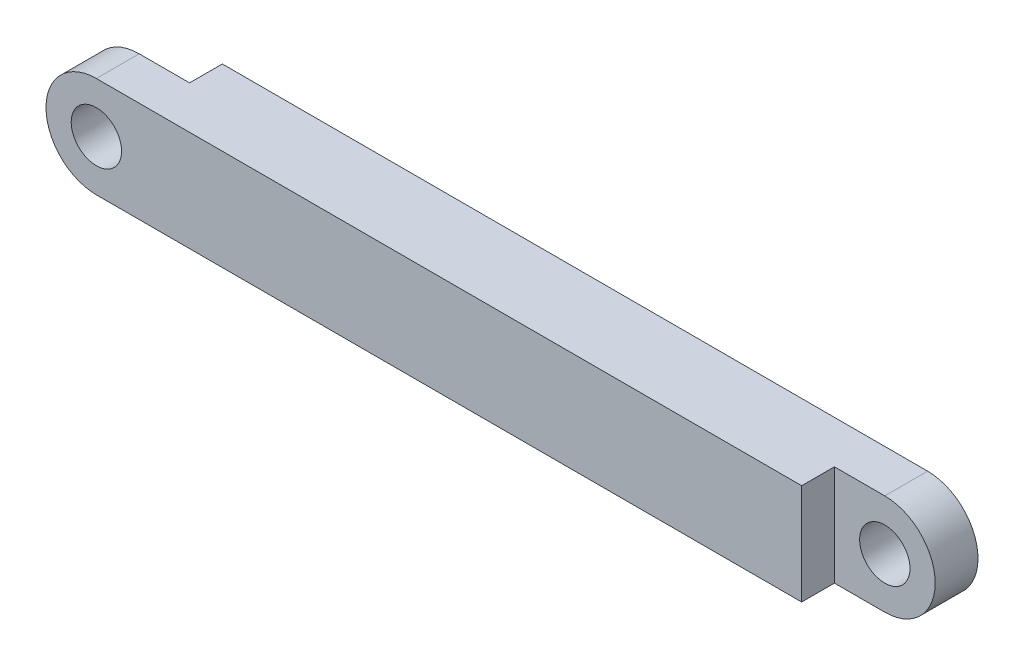
ISO-10303-21;
HEADER;
FILE_DESCRIPTION(('STEP AP214'),'2;1');
FILE_NAME('part.step','',(''),(''),'','','');
FILE_SCHEMA(('AUTOMOTIVE_DESIGN { 1 0 10303 214 1 1 1 1 }'));
ENDSEC;
DATA;
#1=APPLICATION_CONTEXT('core data for automotive mechanical design processes');
#2=APPLICATION_PROTOCOL_DEFINITION('international standard','automotive_design',2000,#1);
#3=PRODUCT_CONTEXT('',#1,'mechanical');
#4=PRODUCT('Part','Part','',(#3));
#5=PRODUCT_RELATED_PRODUCT_CATEGORY('part','',(#4));
#6=PRODUCT_DEFINITION_FORMATION('','',#4);
#7=PRODUCT_DEFINITION_CONTEXT('part definition',#1,'design');
#8=PRODUCT_DEFINITION('design','',#6,#7);
#9=PRODUCT_DEFINITION_SHAPE('','',#8);
#10=(LENGTH_UNIT() NAMED_UNIT(*) SI_UNIT(.MILLI.,.METRE.));
#11=(NAMED_UNIT(*) PLANE_ANGLE_UNIT() SI_UNIT($,.RADIAN.));
#12=(NAMED_UNIT(*) SI_UNIT($,.STERADIAN.) SOLID_ANGLE_UNIT());
#13=UNCERTAINTY_MEASURE_WITH_UNIT(LENGTH_MEASURE(1.E-05),#10,'distance_accuracy_value','');
#14=(GEOMETRIC_REPRESENTATION_CONTEXT(3) GLOBAL_UNCERTAINTY_ASSIGNED_CONTEXT((#13)) GLOBAL_UNIT_ASSIGNED_CONTEXT((#10,
#11,#12)) REPRESENTATION_CONTEXT('',''));
#15=CARTESIAN_POINT('',(0.,0.,0.));
#16=DIRECTION('',(0.,0.,1.));
#17=DIRECTION('',(1.,0.,0.));
#18=AXIS2_PLACEMENT_3D('',#15,#16,#17);
#19=CARTESIAN_POINT('',(-300.,0.,15.));
#20=DIRECTION('',(0.,0.,-1.));
#21=DIRECTION('',(-1.,0.,0.));
#22=AXIS2_PLACEMENT_3D('',#19,#20,#21);
#23=CYLINDRICAL_SURFACE('',#22,20.);
#24=CARTESIAN_POINT('',(-300.,0.,-2.));
#25=DIRECTION('',(0.,0.,-1.));
#26=DIRECTION('',(-1.,0.,0.));
#27=AXIS2_PLACEMENT_3D('',#24,#25,#26);
#28=CIRCLE('',#27,20.);
#29=CARTESIAN_POINT('',(-300.,-20.,-2.));
#30=VERTEX_POINT('',#29);
#31=CARTESIAN_POINT('',(-300.,20.,-2.));
#32=VERTEX_POINT('',#31);
#33=EDGE_CURVE('E103',#30,#32,#28,.T.);
#34=ORIENTED_EDGE('',*,*,#33,.F.);
#35=DIRECTION('',(0.,0.,-1.));
#36=VECTOR('',#35,1.);
#37=CARTESIAN_POINT('',(-300.,-20.,15.));
#38=LINE('',#37,#36);
#39=CARTESIAN_POINT('',(-300.,-20.,15.));
#40=VERTEX_POINT('',#39);
#41=EDGE_CURVE('E166',#40,#30,#38,.T.);
#42=ORIENTED_EDGE('',*,*,#41,.F.);
#43=CARTESIAN_POINT('',(-300.,0.,15.));
#44=DIRECTION('',(0.,0.,1.));
#45=DIRECTION('',(-1.,0.,0.));
#46=AXIS2_PLACEMENT_3D('',#43,#44,#45);
#47=CIRCLE('',#46,20.);
#48=CARTESIAN_POINT('',(-300.,20.,15.));
#49=VERTEX_POINT('',#48);
#50=EDGE_CURVE('E153',#49,#40,#47,.T.);
#51=ORIENTED_EDGE('',*,*,#50,.F.);
#52=DIRECTION('',(0.,0.,-1.));
#53=VECTOR('',#52,1.);
#54=CARTESIAN_POINT('',(-300.,20.,15.));
#55=LINE('',#54,#53);
#56=EDGE_CURVE('E44',#49,#32,#55,.T.);
#57=ORIENTED_EDGE('',*,*,#56,.T.);
#58=EDGE_LOOP('',(#34,#42,#51,#57));
#59=FACE_BOUND('',#58,.T.);
#60=ADVANCED_FACE('F35',(#59),#23,.T.);
#61=CARTESIAN_POINT('',(-300.,0.,15.));
#62=DIRECTION('',(0.,0.,-1.));
#63=DIRECTION('',(-1.,0.,0.));
#64=AXIS2_PLACEMENT_3D('',#61,#62,#63);
#65=CYLINDRICAL_SURFACE('',#64,10.);
#66=CARTESIAN_POINT('',(-300.,0.,15.));
#67=DIRECTION('',(0.,0.,1.));
#68=DIRECTION('',(1.,0.,0.));
#69=AXIS2_PLACEMENT_3D('',#66,#67,#68);
#70=CIRCLE('',#69,10.);
#71=CARTESIAN_POINT('',(-290.,0.,15.));
#72=VERTEX_POINT('',#71);
#73=EDGE_CURVE('E144',#72,#72,#70,.T.);
#74=ORIENTED_EDGE('',*,*,#73,.T.);
#75=EDGE_LOOP('',(#74));
#76=FACE_BOUND('',#75,.T.);
#77=CARTESIAN_POINT('',(-300.,0.,-2.));
#78=DIRECTION('',(0.,0.,-1.));
#79=DIRECTION('',(-1.,0.,0.));
#80=AXIS2_PLACEMENT_3D('',#77,#78,#79);
#81=CIRCLE('',#80,10.);
#82=CARTESIAN_POINT('',(-310.,0.,-2.));
#83=VERTEX_POINT('',#82);
#84=EDGE_CURVE('E39',#83,#83,#81,.T.);
#85=ORIENTED_EDGE('',*,*,#84,.T.);
#86=EDGE_LOOP('',(#85));
#87=FACE_BOUND('',#86,.T.);
#88=ADVANCED_FACE('F212',(#76,#87),#65,.F.);
#89=CARTESIAN_POINT('',(0.,0.,15.));
#90=DIRECTION('',(0.,0.,-1.));
#91=DIRECTION('',(-1.,0.,0.));
#92=AXIS2_PLACEMENT_3D('',#89,#90,#91);
#93=CYLINDRICAL_SURFACE('',#92,20.);
#94=CARTESIAN_POINT('',(0.,0.,2.));
#95=DIRECTION('',(0.,0.,1.));
#96=DIRECTION('',(1.,0.,0.));
#97=AXIS2_PLACEMENT_3D('',#94,#95,#96);
#98=CIRCLE('',#97,20.);
#99=CARTESIAN_POINT('',(0.,-20.,2.));
#100=VERTEX_POINT('',#99);
#101=CARTESIAN_POINT('',(0.,20.,2.));
#102=VERTEX_POINT('',#101);
#103=EDGE_CURVE('E142',#100,#102,#98,.T.);
#104=ORIENTED_EDGE('',*,*,#103,.F.);
#105=DIRECTION('',(0.,0.,-1.));
#106=VECTOR('',#105,1.);
#107=CARTESIAN_POINT('',(0.,-20.,15.));
#108=LINE('',#107,#106);
#109=CARTESIAN_POINT('',(0.,-20.,-15.));
#110=VERTEX_POINT('',#109);
#111=EDGE_CURVE('E159',#100,#110,#108,.T.);
#112=ORIENTED_EDGE('',*,*,#111,.T.);
#113=CARTESIAN_POINT('',(0.,0.,-15.));
#114=DIRECTION('',(0.,0.,1.));
#115=DIRECTION('',(-1.,0.,0.));
#116=AXIS2_PLACEMENT_3D('',#113,#114,#115);
#117=CIRCLE('',#116,20.);
#118=CARTESIAN_POINT('',(0.,20.,-15.));
#119=VERTEX_POINT('',#118);
#120=EDGE_CURVE('E150',#110,#119,#117,.T.);
#121=ORIENTED_EDGE('',*,*,#120,.T.);
#122=DIRECTION('',(0.,0.,-1.));
#123=VECTOR('',#122,1.);
#124=CARTESIAN_POINT('',(0.,20.,15.));
#125=LINE('',#124,#123);
#126=EDGE_CURVE('E11',#102,#119,#125,.T.);
#127=ORIENTED_EDGE('',*,*,#126,.F.);
#128=EDGE_LOOP('',(#104,#112,#121,#127));
#129=FACE_BOUND('',#128,.T.);
#130=ADVANCED_FACE('F37',(#129),#93,.T.);
#131=CARTESIAN_POINT('',(0.,0.,15.));
#132=DIRECTION('',(0.,0.,-1.));
#133=DIRECTION('',(-1.,0.,0.));
#134=AXIS2_PLACEMENT_3D('',#131,#132,#133);
#135=CYLINDRICAL_SURFACE('',#134,10.);
#136=CARTESIAN_POINT('',(0.,0.,-15.));
#137=DIRECTION('',(0.,0.,1.));
#138=DIRECTION('',(1.,0.,0.));
#139=AXIS2_PLACEMENT_3D('',#136,#137,#138);
#140=CIRCLE('',#139,10.);
#141=CARTESIAN_POINT('',(10.,0.,-15.));
#142=VERTEX_POINT('',#141);
#143=EDGE_CURVE('E147',#142,#142,#140,.T.);
#144=ORIENTED_EDGE('',*,*,#143,.F.);
#145=EDGE_LOOP('',(#144));
#146=FACE_BOUND('',#145,.T.);
#147=CARTESIAN_POINT('',(0.,0.,2.));
#148=DIRECTION('',(0.,0.,1.));
#149=DIRECTION('',(1.,0.,0.));
#150=AXIS2_PLACEMENT_3D('',#147,#148,#149);
#151=CIRCLE('',#150,10.);
#152=CARTESIAN_POINT('',(10.,0.,2.));
#153=VERTEX_POINT('',#152);
#154=EDGE_CURVE('E140',#153,#153,#151,.T.);
#155=ORIENTED_EDGE('',*,*,#154,.T.);
#156=EDGE_LOOP('',(#155));
#157=FACE_BOUND('',#156,.T.);
#158=ADVANCED_FACE('F172',(#146,#157),#135,.F.);
#159=CARTESIAN_POINT('',(0.,0.,15.));
#160=DIRECTION('',(0.,0.,-1.));
#161=DIRECTION('',(-1.,0.,0.));
#162=AXIS2_PLACEMENT_3D('',#159,#160,#161);
#163=PLANE('',#162);
#164=DIRECTION('',(1.,0.,0.));
#165=VECTOR('',#164,1.);
#166=CARTESIAN_POINT('',(0.,-20.,15.));
#167=LINE('',#166,#165);
#168=CARTESIAN_POINT('',(-20.,-20.,15.));
#169=VERTEX_POINT('',#168);
#170=EDGE_CURVE('E156',#40,#169,#167,.T.);
#171=ORIENTED_EDGE('',*,*,#170,.T.);
#172=DIRECTION('',(0.,-1.,0.));
#173=VECTOR('',#172,1.);
#174=CARTESIAN_POINT('',(-20.,-20.,15.));
#175=LINE('',#174,#173);
#176=CARTESIAN_POINT('',(-20.,20.,15.));
#177=VERTEX_POINT('',#176);
#178=EDGE_CURVE('E129',#177,#169,#175,.T.);
#179=ORIENTED_EDGE('',*,*,#178,.F.);
#180=DIRECTION('',(-1.,0.,0.));
#181=VECTOR('',#180,1.);
#182=CARTESIAN_POINT('',(0.,20.,15.));
#183=LINE('',#182,#181);
#184=EDGE_CURVE('E151',#177,#49,#183,.T.);
#185=ORIENTED_EDGE('',*,*,#184,.T.);
#186=ORIENTED_EDGE('',*,*,#50,.T.);
#187=EDGE_LOOP('',(#171,#179,#185,#186));
#188=FACE_BOUND('',#187,.T.);
#189=ORIENTED_EDGE('',*,*,#73,.F.);
#190=EDGE_LOOP('',(#189));
#191=FACE_BOUND('',#190,.T.);
#192=ADVANCED_FACE('F199',(#188,#191),#163,.F.);
#193=CARTESIAN_POINT('',(0.,0.,-15.));
#194=DIRECTION('',(0.,0.,-1.));
#195=DIRECTION('',(-1.,0.,0.));
#196=AXIS2_PLACEMENT_3D('',#193,#194,#195);
#197=PLANE('',#196);
#198=DIRECTION('',(0.,-1.,0.));
#199=VECTOR('',#198,1.);
#200=CARTESIAN_POINT('',(-280.,-20.,-15.));
#201=LINE('',#200,#199);
#202=CARTESIAN_POINT('',(-280.,20.,-15.));
#203=VERTEX_POINT('',#202);
#204=CARTESIAN_POINT('',(-280.,-20.,-15.));
#205=VERTEX_POINT('',#204);
#206=EDGE_CURVE('E117',#203,#205,#201,.T.);
#207=ORIENTED_EDGE('',*,*,#206,.F.);
#208=DIRECTION('',(-1.,0.,0.));
#209=VECTOR('',#208,1.);
#210=CARTESIAN_POINT('',(0.,20.,-15.));
#211=LINE('',#210,#209);
#212=EDGE_CURVE('E122',#119,#203,#211,.T.);
#213=ORIENTED_EDGE('',*,*,#212,.F.);
#214=ORIENTED_EDGE('',*,*,#120,.F.);
#215=DIRECTION('',(1.,0.,0.));
#216=VECTOR('',#215,1.);
#217=CARTESIAN_POINT('',(0.,-20.,-15.));
#218=LINE('',#217,#216);
#219=EDGE_CURVE('E154',#205,#110,#218,.T.);
#220=ORIENTED_EDGE('',*,*,#219,.F.);
#221=EDGE_LOOP('',(#207,#213,#214,#220));
#222=FACE_BOUND('',#221,.T.);
#223=ORIENTED_EDGE('',*,*,#143,.T.);
#224=EDGE_LOOP('',(#223));
#225=FACE_BOUND('',#224,.T.);
#226=ADVANCED_FACE('F189',(#222,#225),#197,.T.);
#227=CARTESIAN_POINT('',(0.,20.,15.));
#228=DIRECTION('',(0.,-1.,0.));
#229=DIRECTION('',(0.,0.,-1.));
#230=AXIS2_PLACEMENT_3D('',#227,#228,#229);
#231=PLANE('',#230);
#232=ORIENTED_EDGE('',*,*,#212,.T.);
#233=DIRECTION('',(0.,0.,-1.));
#234=VECTOR('',#233,1.);
#235=CARTESIAN_POINT('',(-280.,20.,-2.));
#236=LINE('',#235,#234);
#237=CARTESIAN_POINT('',(-280.,20.,-2.));
#238=VERTEX_POINT('',#237);
#239=EDGE_CURVE('E113',#238,#203,#236,.T.);
#240=ORIENTED_EDGE('',*,*,#239,.F.);
#241=DIRECTION('',(1.,0.,0.));
#242=VECTOR('',#241,1.);
#243=CARTESIAN_POINT('',(-320.,20.,-2.));
#244=LINE('',#243,#242);
#245=EDGE_CURVE('E101',#32,#238,#244,.T.);
#246=ORIENTED_EDGE('',*,*,#245,.F.);
#247=ORIENTED_EDGE('',*,*,#56,.F.);
#248=ORIENTED_EDGE('',*,*,#184,.F.);
#249=DIRECTION('',(0.,0.,1.));
#250=VECTOR('',#249,1.);
#251=CARTESIAN_POINT('',(-20.,20.,2.));
#252=LINE('',#251,#250);
#253=CARTESIAN_POINT('',(-20.,20.,2.));
#254=VERTEX_POINT('',#253);
#255=EDGE_CURVE('E135',#254,#177,#252,.T.);
#256=ORIENTED_EDGE('',*,*,#255,.F.);
#257=DIRECTION('',(-1.,0.,0.));
#258=VECTOR('',#257,1.);
#259=CARTESIAN_POINT('',(-20.,20.,2.));
#260=LINE('',#259,#258);
#261=EDGE_CURVE('E132',#102,#254,#260,.T.);
#262=ORIENTED_EDGE('',*,*,#261,.F.);
#263=ORIENTED_EDGE('',*,*,#126,.T.);
#264=EDGE_LOOP('',(#232,#240,#246,#247,#248,#256,#262,#263));
#265=FACE_BOUND('',#264,.T.);
#266=ADVANCED_FACE('F120',(#265),#231,.F.);
#267=CARTESIAN_POINT('',(0.,-20.,15.));
#268=DIRECTION('',(0.,1.,0.));
#269=DIRECTION('',(0.,0.,1.));
#270=AXIS2_PLACEMENT_3D('',#267,#268,#269);
#271=PLANE('',#270);
#272=DIRECTION('',(-1.,0.,0.));
#273=VECTOR('',#272,1.);
#274=CARTESIAN_POINT('',(-320.,-20.,-2.));
#275=LINE('',#274,#273);
#276=CARTESIAN_POINT('',(-280.,-20.,-2.));
#277=VERTEX_POINT('',#276);
#278=EDGE_CURVE('E109',#277,#30,#275,.T.);
#279=ORIENTED_EDGE('',*,*,#278,.F.);
#280=DIRECTION('',(0.,0.,-1.));
#281=VECTOR('',#280,1.);
#282=CARTESIAN_POINT('',(-280.,-20.,-2.));
#283=LINE('',#282,#281);
#284=EDGE_CURVE('E108',#277,#205,#283,.T.);
#285=ORIENTED_EDGE('',*,*,#284,.T.);
#286=ORIENTED_EDGE('',*,*,#219,.T.);
#287=ORIENTED_EDGE('',*,*,#111,.F.);
#288=DIRECTION('',(1.,0.,0.));
#289=VECTOR('',#288,1.);
#290=CARTESIAN_POINT('',(-20.,-20.,2.));
#291=LINE('',#290,#289);
#292=CARTESIAN_POINT('',(-20.,-20.,2.));
#293=VERTEX_POINT('',#292);
#294=EDGE_CURVE('E130',#293,#100,#291,.T.);
#295=ORIENTED_EDGE('',*,*,#294,.F.);
#296=DIRECTION('',(0.,0.,1.));
#297=VECTOR('',#296,1.);
#298=CARTESIAN_POINT('',(-20.,-20.,2.));
#299=LINE('',#298,#297);
#300=EDGE_CURVE('E137',#293,#169,#299,.T.);
#301=ORIENTED_EDGE('',*,*,#300,.T.);
#302=ORIENTED_EDGE('',*,*,#170,.F.);
#303=ORIENTED_EDGE('',*,*,#41,.T.);
#304=EDGE_LOOP('',(#279,#285,#286,#287,#295,#301,#302,#303));
#305=FACE_BOUND('',#304,.T.);
#306=ADVANCED_FACE('F177',(#305),#271,.F.);
#307=CARTESIAN_POINT('',(0.,0.,2.));
#308=DIRECTION('',(0.,0.,1.));
#309=DIRECTION('',(1.,0.,0.));
#310=AXIS2_PLACEMENT_3D('',#307,#308,#309);
#311=PLANE('',#310);
#312=ORIENTED_EDGE('',*,*,#154,.F.);
#313=EDGE_LOOP('',(#312));
#314=FACE_BOUND('',#313,.T.);
#315=ORIENTED_EDGE('',*,*,#103,.T.);
#316=ORIENTED_EDGE('',*,*,#261,.T.);
#317=DIRECTION('',(0.,-1.,0.));
#318=VECTOR('',#317,1.);
#319=CARTESIAN_POINT('',(-20.,-20.,2.));
#320=LINE('',#319,#318);
#321=EDGE_CURVE('E60',#254,#293,#320,.T.);
#322=ORIENTED_EDGE('',*,*,#321,.T.);
#323=ORIENTED_EDGE('',*,*,#294,.T.);
#324=EDGE_LOOP('',(#315,#316,#322,#323));
#325=FACE_BOUND('',#324,.T.);
#326=ADVANCED_FACE('F174',(#314,#325),#311,.T.);
#327=CARTESIAN_POINT('',(-20.,-20.,2.));
#328=DIRECTION('',(-1.,0.,0.));
#329=DIRECTION('',(0.,-1.,0.));
#330=AXIS2_PLACEMENT_3D('',#327,#328,#329);
#331=PLANE('',#330);
#332=ORIENTED_EDGE('',*,*,#178,.T.);
#333=ORIENTED_EDGE('',*,*,#300,.F.);
#334=ORIENTED_EDGE('',*,*,#321,.F.);
#335=ORIENTED_EDGE('',*,*,#255,.T.);
#336=EDGE_LOOP('',(#332,#333,#334,#335));
#337=FACE_BOUND('',#336,.T.);
#338=ADVANCED_FACE('F176',(#337),#331,.F.);
#339=CARTESIAN_POINT('',(0.,0.,-2.));
#340=DIRECTION('',(0.,0.,-1.));
#341=DIRECTION('',(-1.,0.,0.));
#342=AXIS2_PLACEMENT_3D('',#339,#340,#341);
#343=PLANE('',#342);
#344=ORIENTED_EDGE('',*,*,#84,.F.);
#345=EDGE_LOOP('',(#344));
#346=FACE_BOUND('',#345,.T.);
#347=ORIENTED_EDGE('',*,*,#33,.T.);
#348=ORIENTED_EDGE('',*,*,#245,.T.);
#349=DIRECTION('',(0.,-1.,0.));
#350=VECTOR('',#349,1.);
#351=CARTESIAN_POINT('',(-280.,-20.,-2.));
#352=LINE('',#351,#350);
#353=EDGE_CURVE('E52',#238,#277,#352,.T.);
#354=ORIENTED_EDGE('',*,*,#353,.T.);
#355=ORIENTED_EDGE('',*,*,#278,.T.);
#356=EDGE_LOOP('',(#347,#348,#354,#355));
#357=FACE_BOUND('',#356,.T.);
#358=ADVANCED_FACE('F102',(#346,#357),#343,.T.);
#359=CARTESIAN_POINT('',(-280.,-20.,-2.));
#360=DIRECTION('',(1.,0.,0.));
#361=DIRECTION('',(0.,0.,-1.));
#362=AXIS2_PLACEMENT_3D('',#359,#360,#361);
#363=PLANE('',#362);
#364=ORIENTED_EDGE('',*,*,#206,.T.);
#365=ORIENTED_EDGE('',*,*,#284,.F.);
#366=ORIENTED_EDGE('',*,*,#353,.F.);
#367=ORIENTED_EDGE('',*,*,#239,.T.);
#368=EDGE_LOOP('',(#364,#365,#366,#367));
#369=FACE_BOUND('',#368,.T.);
#370=ADVANCED_FACE('F112',(#369),#363,.F.);
#371=CLOSED_SHELL('',(#60,#88,#130,#158,#192,#226,#266,#306,#326,#338,#358,#370));
#372=MANIFOLD_SOLID_BREP('B2',#371);
#373=ADVANCED_BREP_SHAPE_REPRESENTATION('',(#18,#372),#14);
#374=SHAPE_DEFINITION_REPRESENTATION(#9,#373);
ENDSEC;
END-ISO-10303-21;
